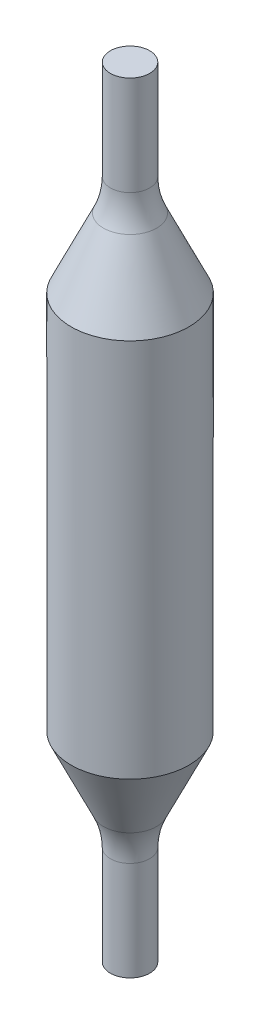
ISO-10303-21;
HEADER;
FILE_DESCRIPTION(('STEP AP214'),'2;1');
FILE_NAME('part.step','',(''),(''),'','','');
FILE_SCHEMA(('AUTOMOTIVE_DESIGN { 1 0 10303 214 1 1 1 1 }'));
ENDSEC;
DATA;
#1=APPLICATION_CONTEXT('core data for automotive mechanical design processes');
#2=APPLICATION_PROTOCOL_DEFINITION('international standard','automotive_design',2000,#1);
#3=PRODUCT_CONTEXT('',#1,'mechanical');
#4=PRODUCT('Part','Part','',(#3));
#5=PRODUCT_RELATED_PRODUCT_CATEGORY('part','',(#4));
#6=PRODUCT_DEFINITION_FORMATION('','',#4);
#7=PRODUCT_DEFINITION_CONTEXT('part definition',#1,'design');
#8=PRODUCT_DEFINITION('design','',#6,#7);
#9=PRODUCT_DEFINITION_SHAPE('','',#8);
#10=(LENGTH_UNIT() NAMED_UNIT(*) SI_UNIT(.MILLI.,.METRE.));
#11=(NAMED_UNIT(*) PLANE_ANGLE_UNIT() SI_UNIT($,.RADIAN.));
#12=(NAMED_UNIT(*) SI_UNIT($,.STERADIAN.) SOLID_ANGLE_UNIT());
#13=UNCERTAINTY_MEASURE_WITH_UNIT(LENGTH_MEASURE(1.E-05),#10,'distance_accuracy_value','');
#14=(GEOMETRIC_REPRESENTATION_CONTEXT(3) GLOBAL_UNCERTAINTY_ASSIGNED_CONTEXT((#13)) GLOBAL_UNIT_ASSIGNED_CONTEXT((#10,
#11,#12)) REPRESENTATION_CONTEXT('',''));
#15=CARTESIAN_POINT('',(0.,0.,0.));
#16=DIRECTION('',(0.,0.,1.));
#17=DIRECTION('',(1.,0.,0.));
#18=AXIS2_PLACEMENT_3D('',#15,#16,#17);
#19=CARTESIAN_POINT('',(-3.2131,29.5,3.2131));
#20=DIRECTION('',(0.,-1.,0.));
#21=DIRECTION('',(0.,0.,-1.));
#22=AXIS2_PLACEMENT_3D('',#19,#20,#21);
#23=PLANE('',#22);
#24=CARTESIAN_POINT('',(0.,29.5,0.));
#25=DIRECTION('',(0.,1.,0.));
#26=DIRECTION('',(-1.,0.,0.));
#27=AXIS2_PLACEMENT_3D('',#24,#25,#26);
#28=CIRCLE('',#27,3.175);
#29=CARTESIAN_POINT('',(-3.175,29.5,0.));
#30=VERTEX_POINT('',#29);
#31=EDGE_CURVE('E19',#30,#30,#28,.F.);
#32=ORIENTED_EDGE('',*,*,#31,.T.);
#33=EDGE_LOOP('',(#32));
#34=FACE_BOUND('',#33,.T.);
#35=ADVANCED_FACE('F15',(#34),#23,.T.);
#36=CARTESIAN_POINT('',(0.,29.5,0.));
#37=DIRECTION('',(0.,1.,0.));
#38=DIRECTION('',(-1.,0.,0.));
#39=AXIS2_PLACEMENT_3D('',#36,#37,#38);
#40=CYLINDRICAL_SURFACE('',#39,3.175);
#41=ORIENTED_EDGE('',*,*,#31,.F.);
#42=EDGE_LOOP('',(#41));
#43=FACE_BOUND('',#42,.T.);
#44=CARTESIAN_POINT('',(0.,45.5391017598682,0.));
#45=DIRECTION('',(0.,-1.,0.));
#46=DIRECTION('',(1.,0.,0.));
#47=AXIS2_PLACEMENT_3D('',#44,#45,#46);
#48=CIRCLE('',#47,3.17500000035273);
#49=CARTESIAN_POINT('',(3.17500000035273,45.5391017598682,0.));
#50=VERTEX_POINT('',#49);
#51=EDGE_CURVE('E39',#50,#50,#48,.T.);
#52=ORIENTED_EDGE('',*,*,#51,.T.);
#53=EDGE_LOOP('',(#52));
#54=FACE_BOUND('',#53,.T.);
#55=ADVANCED_FACE('F118',(#43,#54),#40,.T.);
#56=CARTESIAN_POINT('',(0.,45.539101763186,0.));
#57=DIRECTION('',(0.,-1.,0.));
#58=DIRECTION('',(0.,0.,-1.));
#59=AXIS2_PLACEMENT_3D('',#56,#57,#58);
#60=TOROIDAL_SURFACE('',#59,15.1749999997763,11.999999999619);
#61=CARTESIAN_POINT('',(0.,50.6105209050001,0.));
#62=DIRECTION('',(0.,1.,0.));
#63=DIRECTION('',(0.,0.,1.));
#64=AXIS2_PLACEMENT_3D('',#61,#62,#63);
#65=CIRCLE('',#64,4.299306556);
#66=CARTESIAN_POINT('',(0.,50.610520905,4.299306556));
#67=VERTEX_POINT('',#66);
#68=EDGE_CURVE('E36',#67,#67,#65,.F.);
#69=ORIENTED_EDGE('',*,*,#68,.T.);
#70=EDGE_LOOP('',(#69));
#71=FACE_BOUND('',#70,.T.);
#72=ORIENTED_EDGE('',*,*,#51,.F.);
#73=EDGE_LOOP('',(#72));
#74=FACE_BOUND('',#73,.T.);
#75=ADVANCED_FACE('F108',(#71,#74),#60,.F.);
#76=CARTESIAN_POINT('',(0.,50.610520905,0.));
#77=DIRECTION('',(0.,1.,0.));
#78=DIRECTION('',(-1.,0.,0.));
#79=AXIS2_PLACEMENT_3D('',#76,#77,#78);
#80=CONICAL_SURFACE('',#79,4.299306556,0.436332312968487);
#81=ORIENTED_EDGE('',*,*,#68,.F.);
#82=EDGE_LOOP('',(#81));
#83=FACE_BOUND('',#82,.T.);
#84=CARTESIAN_POINT('',(0.,61.817056661,0.));
#85=DIRECTION('',(0.,-1.,0.));
#86=DIRECTION('',(0.,0.,-1.));
#87=AXIS2_PLACEMENT_3D('',#84,#85,#86);
#88=CIRCLE('',#87,9.525);
#89=CARTESIAN_POINT('',(0.,61.817056661,-9.525));
#90=VERTEX_POINT('',#89);
#91=EDGE_CURVE('E33',#90,#90,#88,.T.);
#92=ORIENTED_EDGE('',*,*,#91,.T.);
#93=EDGE_LOOP('',(#92));
#94=FACE_BOUND('',#93,.T.);
#95=ADVANCED_FACE('F100',(#83,#94),#80,.T.);
#96=CARTESIAN_POINT('',(0.,123.182943339,0.));
#97=DIRECTION('',(0.,-1.,0.));
#98=DIRECTION('',(1.,0.,0.));
#99=AXIS2_PLACEMENT_3D('',#96,#97,#98);
#100=CYLINDRICAL_SURFACE('',#99,9.525);
#101=CARTESIAN_POINT('',(0.,123.182943339,0.));
#102=DIRECTION('',(0.,-1.,0.));
#103=DIRECTION('',(0.,0.,-1.));
#104=AXIS2_PLACEMENT_3D('',#101,#102,#103);
#105=CIRCLE('',#104,9.525);
#106=CARTESIAN_POINT('',(0.,123.182943339,-9.525));
#107=VERTEX_POINT('',#106);
#108=EDGE_CURVE('E32',#107,#107,#105,.T.);
#109=ORIENTED_EDGE('',*,*,#108,.T.);
#110=EDGE_LOOP('',(#109));
#111=FACE_BOUND('',#110,.T.);
#112=ORIENTED_EDGE('',*,*,#91,.F.);
#113=EDGE_LOOP('',(#112));
#114=FACE_BOUND('',#113,.T.);
#115=ADVANCED_FACE('F49',(#111,#114),#100,.T.);
#116=CARTESIAN_POINT('',(-3.2131,155.5,-3.2131));
#117=DIRECTION('',(0.,1.,0.));
#118=DIRECTION('',(0.,0.,1.));
#119=AXIS2_PLACEMENT_3D('',#116,#117,#118);
#120=PLANE('',#119);
#121=CARTESIAN_POINT('',(0.,155.5,0.));
#122=DIRECTION('',(0.,-1.,0.));
#123=DIRECTION('',(1.,0.,0.));
#124=AXIS2_PLACEMENT_3D('',#121,#122,#123);
#125=CIRCLE('',#124,3.175);
#126=CARTESIAN_POINT('',(3.175,155.5,0.));
#127=VERTEX_POINT('',#126);
#128=EDGE_CURVE('E28',#127,#127,#125,.F.);
#129=ORIENTED_EDGE('',*,*,#128,.T.);
#130=EDGE_LOOP('',(#129));
#131=FACE_BOUND('',#130,.T.);
#132=ADVANCED_FACE('F55',(#131),#120,.T.);
#133=CARTESIAN_POINT('',(0.,134.389479095,0.));
#134=DIRECTION('',(0.,-1.,0.));
#135=DIRECTION('',(0.,0.,-1.));
#136=AXIS2_PLACEMENT_3D('',#133,#134,#135);
#137=CONICAL_SURFACE('',#136,4.299306556,0.436332312968485);
#138=CARTESIAN_POINT('',(0.,134.389479091974,0.));
#139=DIRECTION('',(0.,-1.,0.));
#140=DIRECTION('',(1.,0.,0.));
#141=AXIS2_PLACEMENT_3D('',#138,#139,#140);
#142=CIRCLE('',#141,4.29930655736375);
#143=CARTESIAN_POINT('',(4.29930655736375,134.389479091974,0.));
#144=VERTEX_POINT('',#143);
#145=EDGE_CURVE('E23',#144,#144,#142,.T.);
#146=ORIENTED_EDGE('',*,*,#145,.T.);
#147=EDGE_LOOP('',(#146));
#148=FACE_BOUND('',#147,.T.);
#149=ORIENTED_EDGE('',*,*,#108,.F.);
#150=EDGE_LOOP('',(#149));
#151=FACE_BOUND('',#150,.T.);
#152=ADVANCED_FACE('F52',(#148,#151),#137,.T.);
#153=CARTESIAN_POINT('',(0.,155.5,0.));
#154=DIRECTION('',(0.,-1.,0.));
#155=DIRECTION('',(1.,0.,0.));
#156=AXIS2_PLACEMENT_3D('',#153,#154,#155);
#157=CYLINDRICAL_SURFACE('',#156,3.175);
#158=ORIENTED_EDGE('',*,*,#128,.F.);
#159=EDGE_LOOP('',(#158));
#160=FACE_BOUND('',#159,.T.);
#161=CARTESIAN_POINT('',(0.,139.460898240132,0.));
#162=DIRECTION('',(0.,1.,0.));
#163=DIRECTION('',(0.,0.,1.));
#164=AXIS2_PLACEMENT_3D('',#161,#162,#163);
#165=CIRCLE('',#164,3.17500000035273);
#166=CARTESIAN_POINT('',(0.,139.460898240132,3.17500000035273));
#167=VERTEX_POINT('',#166);
#168=EDGE_CURVE('E10',#167,#167,#165,.T.);
#169=ORIENTED_EDGE('',*,*,#168,.T.);
#170=EDGE_LOOP('',(#169));
#171=FACE_BOUND('',#170,.T.);
#172=ADVANCED_FACE('F54',(#160,#171),#157,.T.);
#173=CARTESIAN_POINT('',(0.,139.460898236814,0.));
#174=DIRECTION('',(0.,1.,0.));
#175=DIRECTION('',(0.,0.,1.));
#176=AXIS2_PLACEMENT_3D('',#173,#174,#175);
#177=TOROIDAL_SURFACE('',#176,15.1749999997761,11.9999999996189);
#178=ORIENTED_EDGE('',*,*,#145,.F.);
#179=EDGE_LOOP('',(#178));
#180=FACE_BOUND('',#179,.T.);
#181=ORIENTED_EDGE('',*,*,#168,.F.);
#182=EDGE_LOOP('',(#181));
#183=FACE_BOUND('',#182,.T.);
#184=ADVANCED_FACE('F17',(#180,#183),#177,.F.);
#185=CLOSED_SHELL('',(#35,#55,#75,#95,#115,#132,#152,#172,#184));
#186=MANIFOLD_SOLID_BREP('B1',#185);
#187=ADVANCED_BREP_SHAPE_REPRESENTATION('',(#18,#186),#14);
#188=SHAPE_DEFINITION_REPRESENTATION(#9,#187);
ENDSEC;
END-ISO-10303-21;
